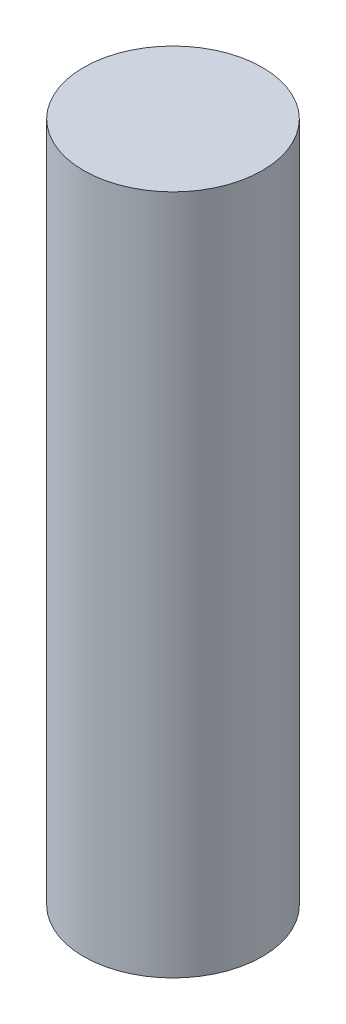
ISO-10303-21;
HEADER;
FILE_DESCRIPTION(('STEP AP214'),'2;1');
FILE_NAME('part.step','',(''),(''),'','','');
FILE_SCHEMA(('AUTOMOTIVE_DESIGN { 1 0 10303 214 1 1 1 1 }'));
ENDSEC;
DATA;
#1=APPLICATION_CONTEXT('core data for automotive mechanical design processes');
#2=APPLICATION_PROTOCOL_DEFINITION('international standard','automotive_design',2000,#1);
#3=PRODUCT_CONTEXT('',#1,'mechanical');
#4=PRODUCT('Part','Part','',(#3));
#5=PRODUCT_RELATED_PRODUCT_CATEGORY('part','',(#4));
#6=PRODUCT_DEFINITION_FORMATION('','',#4);
#7=PRODUCT_DEFINITION_CONTEXT('part definition',#1,'design');
#8=PRODUCT_DEFINITION('design','',#6,#7);
#9=PRODUCT_DEFINITION_SHAPE('','',#8);
#10=(LENGTH_UNIT() NAMED_UNIT(*) SI_UNIT(.MILLI.,.METRE.));
#11=(NAMED_UNIT(*) PLANE_ANGLE_UNIT() SI_UNIT($,.RADIAN.));
#12=(NAMED_UNIT(*) SI_UNIT($,.STERADIAN.) SOLID_ANGLE_UNIT());
#13=UNCERTAINTY_MEASURE_WITH_UNIT(LENGTH_MEASURE(1.E-05),#10,'distance_accuracy_value','');
#14=(GEOMETRIC_REPRESENTATION_CONTEXT(3) GLOBAL_UNCERTAINTY_ASSIGNED_CONTEXT((#13)) GLOBAL_UNIT_ASSIGNED_CONTEXT((#10,
#11,#12)) REPRESENTATION_CONTEXT('',''));
#15=CARTESIAN_POINT('',(0.,0.,0.));
#16=DIRECTION('',(0.,0.,1.));
#17=DIRECTION('',(1.,0.,0.));
#18=AXIS2_PLACEMENT_3D('',#15,#16,#17);
#19=CARTESIAN_POINT('',(0.,8.,0.));
#20=DIRECTION('',(0.,-1.,0.));
#21=DIRECTION('',(0.,0.,1.));
#22=AXIS2_PLACEMENT_3D('',#19,#20,#21);
#23=CYLINDRICAL_SURFACE('',#22,1.05);
#24=CARTESIAN_POINT('',(0.,8.,0.));
#25=DIRECTION('',(0.,-1.,0.));
#26=DIRECTION('',(0.,0.,-1.));
#27=AXIS2_PLACEMENT_3D('',#24,#25,#26);
#28=CIRCLE('',#27,1.05);
#29=CARTESIAN_POINT('',(0.,8.,-1.05));
#30=VERTEX_POINT('',#29);
#31=EDGE_CURVE('E10',#30,#30,#28,.T.);
#32=ORIENTED_EDGE('',*,*,#31,.T.);
#33=EDGE_LOOP('',(#32));
#34=FACE_BOUND('',#33,.T.);
#35=CARTESIAN_POINT('',(0.,0.,0.));
#36=DIRECTION('',(0.,-1.,0.));
#37=DIRECTION('',(0.,0.,-1.));
#38=AXIS2_PLACEMENT_3D('',#35,#36,#37);
#39=CIRCLE('',#38,1.05);
#40=CARTESIAN_POINT('',(0.,0.,-1.05));
#41=VERTEX_POINT('',#40);
#42=EDGE_CURVE('E42',#41,#41,#39,.T.);
#43=ORIENTED_EDGE('',*,*,#42,.F.);
#44=EDGE_LOOP('',(#43));
#45=FACE_BOUND('',#44,.T.);
#46=ADVANCED_FACE('F39',(#34,#45),#23,.T.);
#47=CARTESIAN_POINT('',(0.,8.,0.));
#48=DIRECTION('',(0.,1.,0.));
#49=DIRECTION('',(0.,0.,-1.));
#50=AXIS2_PLACEMENT_3D('',#47,#48,#49);
#51=PLANE('',#50);
#52=ORIENTED_EDGE('',*,*,#31,.F.);
#53=EDGE_LOOP('',(#52));
#54=FACE_BOUND('',#53,.T.);
#55=ADVANCED_FACE('F54',(#54),#51,.T.);
#56=CARTESIAN_POINT('',(0.,0.,0.));
#57=DIRECTION('',(0.,1.,0.));
#58=DIRECTION('',(0.,0.,-1.));
#59=AXIS2_PLACEMENT_3D('',#56,#57,#58);
#60=PLANE('',#59);
#61=ORIENTED_EDGE('',*,*,#42,.T.);
#62=EDGE_LOOP('',(#61));
#63=FACE_BOUND('',#62,.T.);
#64=ADVANCED_FACE('F51',(#63),#60,.F.);
#65=CLOSED_SHELL('',(#46,#55,#64));
#66=MANIFOLD_SOLID_BREP('B2',#65);
#67=ADVANCED_BREP_SHAPE_REPRESENTATION('',(#18,#66),#14);
#68=SHAPE_DEFINITION_REPRESENTATION(#9,#67);
ENDSEC;
END-ISO-10303-21;
